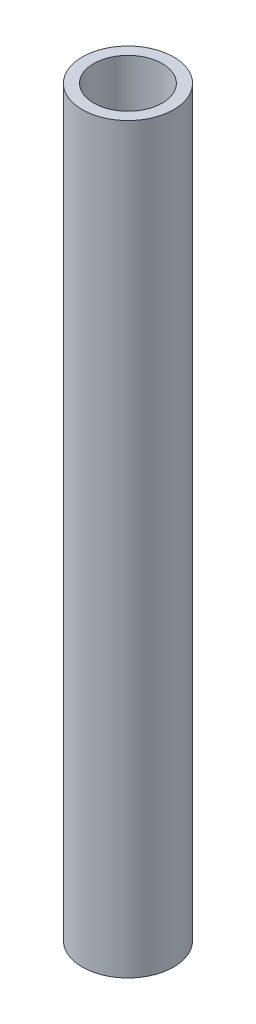
ISO-10303-21;
HEADER;
FILE_DESCRIPTION(('STEP AP214'),'2;1');
FILE_NAME('part.step','',(''),(''),'','','');
FILE_SCHEMA(('AUTOMOTIVE_DESIGN { 1 0 10303 214 1 1 1 1 }'));
ENDSEC;
DATA;
#1=APPLICATION_CONTEXT('core data for automotive mechanical design processes');
#2=APPLICATION_PROTOCOL_DEFINITION('international standard','automotive_design',2000,#1);
#3=PRODUCT_CONTEXT('',#1,'mechanical');
#4=PRODUCT('Part','Part','',(#3));
#5=PRODUCT_RELATED_PRODUCT_CATEGORY('part','',(#4));
#6=PRODUCT_DEFINITION_FORMATION('','',#4);
#7=PRODUCT_DEFINITION_CONTEXT('part definition',#1,'design');
#8=PRODUCT_DEFINITION('design','',#6,#7);
#9=PRODUCT_DEFINITION_SHAPE('','',#8);
#10=(LENGTH_UNIT() NAMED_UNIT(*) SI_UNIT(.MILLI.,.METRE.));
#11=(NAMED_UNIT(*) PLANE_ANGLE_UNIT() SI_UNIT($,.RADIAN.));
#12=(NAMED_UNIT(*) SI_UNIT($,.STERADIAN.) SOLID_ANGLE_UNIT());
#13=UNCERTAINTY_MEASURE_WITH_UNIT(LENGTH_MEASURE(1.E-05),#10,'distance_accuracy_value','');
#14=(GEOMETRIC_REPRESENTATION_CONTEXT(3) GLOBAL_UNCERTAINTY_ASSIGNED_CONTEXT((#13)) GLOBAL_UNIT_ASSIGNED_CONTEXT((#10,
#11,#12)) REPRESENTATION_CONTEXT('',''));
#15=CARTESIAN_POINT('',(0.,0.,0.));
#16=DIRECTION('',(0.,0.,1.));
#17=DIRECTION('',(1.,0.,0.));
#18=AXIS2_PLACEMENT_3D('',#15,#16,#17);
#19=CARTESIAN_POINT('',(0.,130.,0.));
#20=DIRECTION('',(0.,1.,0.));
#21=DIRECTION('',(0.,0.,1.));
#22=AXIS2_PLACEMENT_3D('',#19,#20,#21);
#23=PLANE('',#22);
#24=CARTESIAN_POINT('',(0.,130.,0.));
#25=DIRECTION('',(0.,1.,0.));
#26=DIRECTION('',(0.,0.,1.));
#27=AXIS2_PLACEMENT_3D('',#24,#25,#26);
#28=CIRCLE('',#27,8.);
#29=CARTESIAN_POINT('',(0.,130.,8.));
#30=VERTEX_POINT('',#29);
#31=EDGE_CURVE('E10',#30,#30,#28,.T.);
#32=ORIENTED_EDGE('',*,*,#31,.T.);
#33=EDGE_LOOP('',(#32));
#34=FACE_BOUND('',#33,.T.);
#35=CARTESIAN_POINT('',(0.,130.,0.));
#36=DIRECTION('',(0.,1.,0.));
#37=DIRECTION('',(0.,0.,1.));
#38=AXIS2_PLACEMENT_3D('',#35,#36,#37);
#39=CIRCLE('',#38,6.);
#40=CARTESIAN_POINT('',(0.,130.,6.));
#41=VERTEX_POINT('',#40);
#42=EDGE_CURVE('E50',#41,#41,#39,.T.);
#43=ORIENTED_EDGE('',*,*,#42,.F.);
#44=EDGE_LOOP('',(#43));
#45=FACE_BOUND('',#44,.T.);
#46=ADVANCED_FACE('F37',(#34,#45),#23,.T.);
#47=CARTESIAN_POINT('',(0.,0.,0.));
#48=DIRECTION('',(0.,1.,0.));
#49=DIRECTION('',(0.,0.,1.));
#50=AXIS2_PLACEMENT_3D('',#47,#48,#49);
#51=PLANE('',#50);
#52=CARTESIAN_POINT('',(0.,0.,0.));
#53=DIRECTION('',(0.,1.,0.));
#54=DIRECTION('',(0.,0.,1.));
#55=AXIS2_PLACEMENT_3D('',#52,#53,#54);
#56=CIRCLE('',#55,8.);
#57=CARTESIAN_POINT('',(0.,0.,8.));
#58=VERTEX_POINT('',#57);
#59=EDGE_CURVE('E41',#58,#58,#56,.T.);
#60=ORIENTED_EDGE('',*,*,#59,.F.);
#61=EDGE_LOOP('',(#60));
#62=FACE_BOUND('',#61,.T.);
#63=CARTESIAN_POINT('',(0.,0.,0.));
#64=DIRECTION('',(0.,1.,0.));
#65=DIRECTION('',(0.,0.,1.));
#66=AXIS2_PLACEMENT_3D('',#63,#64,#65);
#67=CIRCLE('',#66,6.);
#68=CARTESIAN_POINT('',(0.,0.,6.));
#69=VERTEX_POINT('',#68);
#70=EDGE_CURVE('E52',#69,#69,#67,.T.);
#71=ORIENTED_EDGE('',*,*,#70,.T.);
#72=EDGE_LOOP('',(#71));
#73=FACE_BOUND('',#72,.T.);
#74=ADVANCED_FACE('F64',(#62,#73),#51,.F.);
#75=CARTESIAN_POINT('',(0.,130.,0.));
#76=DIRECTION('',(0.,-1.,0.));
#77=DIRECTION('',(0.,0.,-1.));
#78=AXIS2_PLACEMENT_3D('',#75,#76,#77);
#79=CYLINDRICAL_SURFACE('',#78,8.);
#80=ORIENTED_EDGE('',*,*,#31,.F.);
#81=EDGE_LOOP('',(#80));
#82=FACE_BOUND('',#81,.T.);
#83=ORIENTED_EDGE('',*,*,#59,.T.);
#84=EDGE_LOOP('',(#83));
#85=FACE_BOUND('',#84,.T.);
#86=ADVANCED_FACE('F39',(#82,#85),#79,.T.);
#87=CARTESIAN_POINT('',(0.,130.,0.));
#88=DIRECTION('',(0.,-1.,0.));
#89=DIRECTION('',(0.,0.,-1.));
#90=AXIS2_PLACEMENT_3D('',#87,#88,#89);
#91=CYLINDRICAL_SURFACE('',#90,6.);
#92=ORIENTED_EDGE('',*,*,#42,.T.);
#93=EDGE_LOOP('',(#92));
#94=FACE_BOUND('',#93,.T.);
#95=ORIENTED_EDGE('',*,*,#70,.F.);
#96=EDGE_LOOP('',(#95));
#97=FACE_BOUND('',#96,.T.);
#98=ADVANCED_FACE('F60',(#94,#97),#91,.F.);
#99=CLOSED_SHELL('',(#46,#74,#86,#98));
#100=MANIFOLD_SOLID_BREP('B2',#99);
#101=ADVANCED_BREP_SHAPE_REPRESENTATION('',(#18,#100),#14);
#102=SHAPE_DEFINITION_REPRESENTATION(#9,#101);
ENDSEC;
END-ISO-10303-21;
